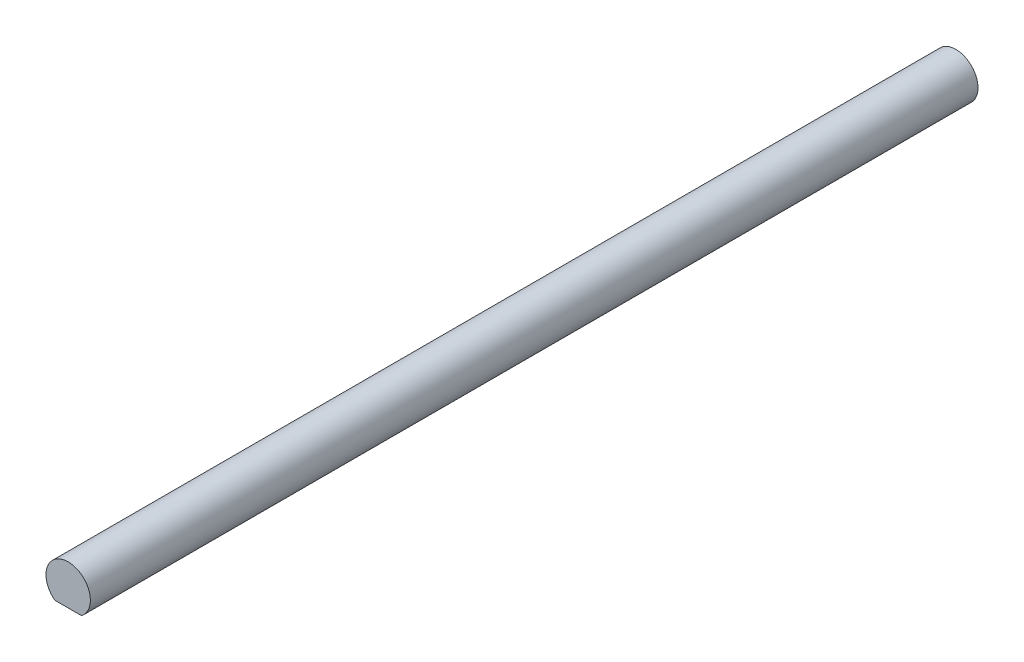
ISO-10303-21;
HEADER;
FILE_DESCRIPTION(('STEP AP214'),'2;1');
FILE_NAME('part.step','',(''),(''),'','','');
FILE_SCHEMA(('AUTOMOTIVE_DESIGN { 1 0 10303 214 1 1 1 1 }'));
ENDSEC;
DATA;
#1=APPLICATION_CONTEXT('core data for automotive mechanical design processes');
#2=APPLICATION_PROTOCOL_DEFINITION('international standard','automotive_design',2000,#1);
#3=PRODUCT_CONTEXT('',#1,'mechanical');
#4=PRODUCT('Part','Part','',(#3));
#5=PRODUCT_RELATED_PRODUCT_CATEGORY('part','',(#4));
#6=PRODUCT_DEFINITION_FORMATION('','',#4);
#7=PRODUCT_DEFINITION_CONTEXT('part definition',#1,'design');
#8=PRODUCT_DEFINITION('design','',#6,#7);
#9=PRODUCT_DEFINITION_SHAPE('','',#8);
#10=(LENGTH_UNIT() NAMED_UNIT(*) SI_UNIT(.MILLI.,.METRE.));
#11=(NAMED_UNIT(*) PLANE_ANGLE_UNIT() SI_UNIT($,.RADIAN.));
#12=(NAMED_UNIT(*) SI_UNIT($,.STERADIAN.) SOLID_ANGLE_UNIT());
#13=UNCERTAINTY_MEASURE_WITH_UNIT(LENGTH_MEASURE(1.E-05),#10,'distance_accuracy_value','');
#14=(GEOMETRIC_REPRESENTATION_CONTEXT(3) GLOBAL_UNCERTAINTY_ASSIGNED_CONTEXT((#13)) GLOBAL_UNIT_ASSIGNED_CONTEXT((#10,
#11,#12)) REPRESENTATION_CONTEXT('',''));
#15=CARTESIAN_POINT('',(0.,0.,0.));
#16=DIRECTION('',(0.,0.,1.));
#17=DIRECTION('',(1.,0.,0.));
#18=AXIS2_PLACEMENT_3D('',#15,#16,#17);
#19=CARTESIAN_POINT('',(0.,-2.54,-63.5));
#20=DIRECTION('',(0.,-1.,0.));
#21=DIRECTION('',(0.,0.,-1.));
#22=AXIS2_PLACEMENT_3D('',#19,#20,#21);
#23=PLANE('',#22);
#24=DIRECTION('',(0.,0.,1.));
#25=VECTOR('',#24,1.);
#26=CARTESIAN_POINT('',(1.905,-2.54,-63.5));
#27=LINE('',#26,#25);
#28=CARTESIAN_POINT('',(1.905,-2.54,-63.5));
#29=VERTEX_POINT('',#28);
#30=CARTESIAN_POINT('',(1.905,-2.54,63.5));
#31=VERTEX_POINT('',#30);
#32=EDGE_CURVE('E42',#29,#31,#27,.T.);
#33=ORIENTED_EDGE('',*,*,#32,.T.);
#34=DIRECTION('',(1.,0.,0.));
#35=VECTOR('',#34,1.);
#36=CARTESIAN_POINT('',(0.,-2.54,63.5));
#37=LINE('',#36,#35);
#38=CARTESIAN_POINT('',(-1.905,-2.54,63.5));
#39=VERTEX_POINT('',#38);
#40=EDGE_CURVE('E63',#39,#31,#37,.T.);
#41=ORIENTED_EDGE('',*,*,#40,.F.);
#42=DIRECTION('',(0.,0.,1.));
#43=VECTOR('',#42,1.);
#44=CARTESIAN_POINT('',(-1.905,-2.54,-63.5));
#45=LINE('',#44,#43);
#46=CARTESIAN_POINT('',(-1.905,-2.54,-63.5));
#47=VERTEX_POINT('',#46);
#48=EDGE_CURVE('E11',#47,#39,#45,.T.);
#49=ORIENTED_EDGE('',*,*,#48,.F.);
#50=DIRECTION('',(1.,0.,0.));
#51=VECTOR('',#50,1.);
#52=CARTESIAN_POINT('',(0.,-2.54,-63.5));
#53=LINE('',#52,#51);
#54=EDGE_CURVE('E64',#47,#29,#53,.T.);
#55=ORIENTED_EDGE('',*,*,#54,.T.);
#56=EDGE_LOOP('',(#33,#41,#49,#55));
#57=FACE_BOUND('',#56,.T.);
#58=ADVANCED_FACE('F39',(#57),#23,.T.);
#59=CARTESIAN_POINT('',(0.,0.,-63.5));
#60=DIRECTION('',(0.,0.,1.));
#61=DIRECTION('',(1.,0.,0.));
#62=AXIS2_PLACEMENT_3D('',#59,#60,#61);
#63=CYLINDRICAL_SURFACE('',#62,3.175);
#64=ORIENTED_EDGE('',*,*,#48,.T.);
#65=CARTESIAN_POINT('',(0.,0.,63.5));
#66=DIRECTION('',(0.,0.,1.));
#67=DIRECTION('',(1.,0.,0.));
#68=AXIS2_PLACEMENT_3D('',#65,#66,#67);
#69=CIRCLE('',#68,3.175);
#70=EDGE_CURVE('E68',#31,#39,#69,.T.);
#71=ORIENTED_EDGE('',*,*,#70,.F.);
#72=ORIENTED_EDGE('',*,*,#32,.F.);
#73=CARTESIAN_POINT('',(0.,0.,-63.5));
#74=DIRECTION('',(0.,0.,1.));
#75=DIRECTION('',(1.,0.,0.));
#76=AXIS2_PLACEMENT_3D('',#73,#74,#75);
#77=CIRCLE('',#76,3.175);
#78=EDGE_CURVE('E66',#29,#47,#77,.T.);
#79=ORIENTED_EDGE('',*,*,#78,.T.);
#80=EDGE_LOOP('',(#64,#71,#72,#79));
#81=FACE_BOUND('',#80,.T.);
#82=ADVANCED_FACE('F69',(#81),#63,.T.);
#83=CARTESIAN_POINT('',(0.,0.,-63.5));
#84=DIRECTION('',(0.,0.,1.));
#85=DIRECTION('',(1.,0.,0.));
#86=AXIS2_PLACEMENT_3D('',#83,#84,#85);
#87=PLANE('',#86);
#88=ORIENTED_EDGE('',*,*,#54,.F.);
#89=ORIENTED_EDGE('',*,*,#78,.F.);
#90=EDGE_LOOP('',(#88,#89));
#91=FACE_BOUND('',#90,.T.);
#92=ADVANCED_FACE('F77',(#91),#87,.F.);
#93=CARTESIAN_POINT('',(0.,0.,63.5));
#94=DIRECTION('',(0.,0.,1.));
#95=DIRECTION('',(1.,0.,0.));
#96=AXIS2_PLACEMENT_3D('',#93,#94,#95);
#97=PLANE('',#96);
#98=ORIENTED_EDGE('',*,*,#40,.T.);
#99=ORIENTED_EDGE('',*,*,#70,.T.);
#100=EDGE_LOOP('',(#98,#99));
#101=FACE_BOUND('',#100,.T.);
#102=ADVANCED_FACE('F72',(#101),#97,.T.);
#103=CLOSED_SHELL('',(#58,#82,#92,#102));
#104=MANIFOLD_SOLID_BREP('B2',#103);
#105=ADVANCED_BREP_SHAPE_REPRESENTATION('',(#18,#104),#14);
#106=SHAPE_DEFINITION_REPRESENTATION(#9,#105);
ENDSEC;
END-ISO-10303-21;
